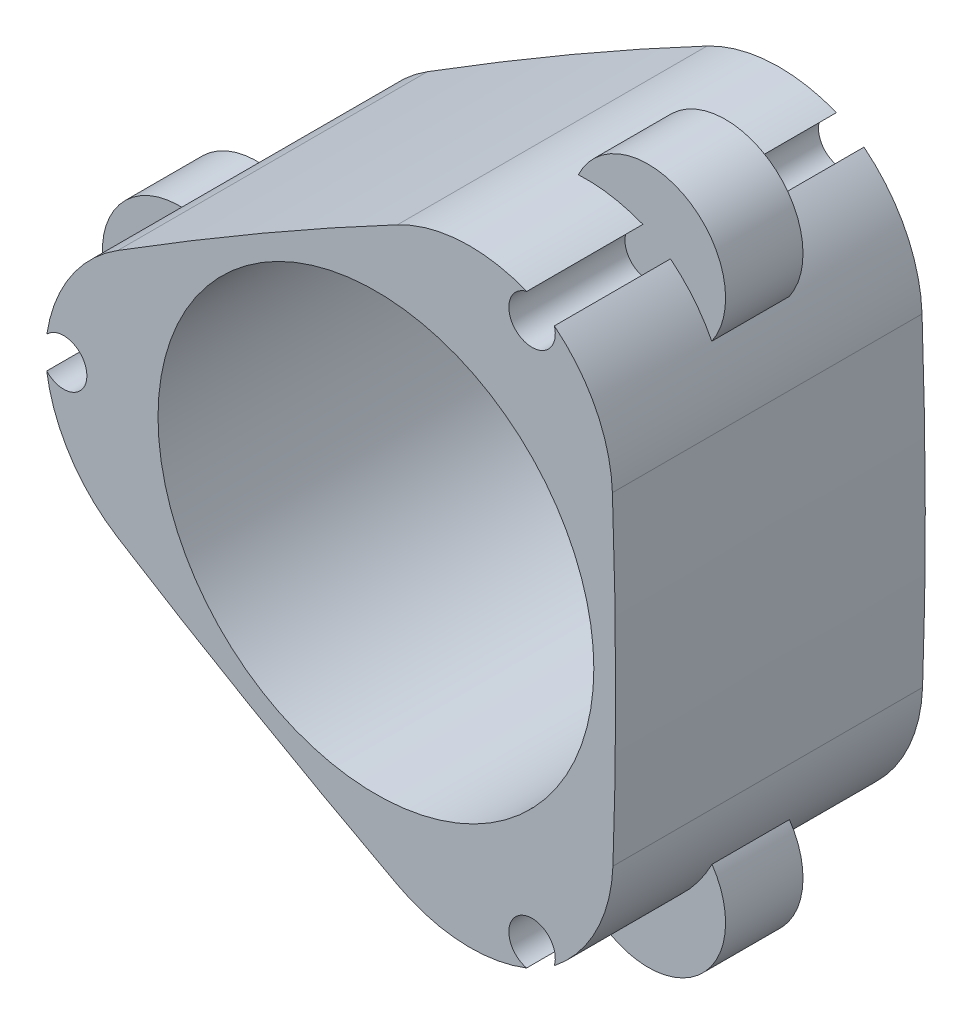
ISO-10303-21;
HEADER;
FILE_DESCRIPTION(('STEP AP214'),'2;1');
FILE_NAME('part.step','',(''),(''),'','','');
FILE_SCHEMA(('AUTOMOTIVE_DESIGN { 1 0 10303 214 1 1 1 1 }'));
ENDSEC;
DATA;
#1=APPLICATION_CONTEXT('core data for automotive mechanical design processes');
#2=APPLICATION_PROTOCOL_DEFINITION('international standard','automotive_design',2000,#1);
#3=PRODUCT_CONTEXT('',#1,'mechanical');
#4=PRODUCT('Part','Part','',(#3));
#5=PRODUCT_RELATED_PRODUCT_CATEGORY('part','',(#4));
#6=PRODUCT_DEFINITION_FORMATION('','',#4);
#7=PRODUCT_DEFINITION_CONTEXT('part definition',#1,'design');
#8=PRODUCT_DEFINITION('design','',#6,#7);
#9=PRODUCT_DEFINITION_SHAPE('','',#8);
#10=(LENGTH_UNIT() NAMED_UNIT(*) SI_UNIT(.MILLI.,.METRE.));
#11=(NAMED_UNIT(*) PLANE_ANGLE_UNIT() SI_UNIT($,.RADIAN.));
#12=(NAMED_UNIT(*) SI_UNIT($,.STERADIAN.) SOLID_ANGLE_UNIT());
#13=UNCERTAINTY_MEASURE_WITH_UNIT(LENGTH_MEASURE(1.E-05),#10,'distance_accuracy_value','');
#14=(GEOMETRIC_REPRESENTATION_CONTEXT(3) GLOBAL_UNCERTAINTY_ASSIGNED_CONTEXT((#13)) GLOBAL_UNIT_ASSIGNED_CONTEXT((#10,
#11,#12)) REPRESENTATION_CONTEXT('',''));
#15=CARTESIAN_POINT('',(0.,0.,0.));
#16=DIRECTION('',(0.,0.,1.));
#17=DIRECTION('',(1.,0.,0.));
#18=AXIS2_PLACEMENT_3D('',#15,#16,#17);
#19=CARTESIAN_POINT('',(5.31444396226365,-10.060029404627,10.));
#20=DIRECTION('',(0.,0.,-1.));
#21=DIRECTION('',(0.499999999999992,-0.866025403784443,0.));
#22=AXIS2_PLACEMENT_3D('',#19,#20,#21);
#23=CYLINDRICAL_SURFACE('',#22,10.);
#24=DIRECTION('',(0.,0.,1.));
#25=VECTOR('',#24,1.);
#26=CARTESIAN_POINT('',(14.2059920047369,-14.6360946804277,10.));
#27=LINE('',#26,#25);
#28=CARTESIAN_POINT('',(14.2059920047369,-14.6360946804277,7.5));
#29=VERTEX_POINT('',#28);
#30=CARTESIAN_POINT('',(14.2059920047369,-14.6360946804277,12.5));
#31=VERTEX_POINT('',#30);
#32=EDGE_CURVE('E196',#29,#31,#27,.T.);
#33=ORIENTED_EDGE('',*,*,#32,.F.);
#34=CARTESIAN_POINT('',(5.31444396226365,-10.060029404627,7.5));
#35=DIRECTION('',(0.,0.,1.));
#36=DIRECTION('',(1.,0.,0.));
#37=AXIS2_PLACEMENT_3D('',#34,#35,#36);
#38=CIRCLE('',#37,10.);
#39=CARTESIAN_POINT('',(11.5201825017126,-17.9015094422218,7.5));
#40=VERTEX_POINT('',#39);
#41=EDGE_CURVE('E205',#29,#40,#38,.F.);
#42=ORIENTED_EDGE('',*,*,#41,.T.);
#43=DIRECTION('',(0.,0.,1.));
#44=VECTOR('',#43,1.);
#45=CARTESIAN_POINT('',(11.5201825017126,-17.9015094422218,10.000006));
#46=LINE('',#45,#44);
#47=CARTESIAN_POINT('',(11.5201825017126,-17.9015094422218,0.));
#48=VERTEX_POINT('',#47);
#49=EDGE_CURVE('E277',#48,#40,#46,.T.);
#50=ORIENTED_EDGE('',*,*,#49,.F.);
#51=CARTESIAN_POINT('',(5.31444396226365,-10.060029404627,0.));
#52=DIRECTION('',(0.,0.,1.));
#53=DIRECTION('',(-0.499999999999992,0.866025403784443,0.));
#54=AXIS2_PLACEMENT_3D('',#51,#52,#53);
#55=CIRCLE('',#54,10.);
#56=CARTESIAN_POINT('',(15.3071980240077,-10.4406424121515,0.));
#57=VERTEX_POINT('',#56);
#58=EDGE_CURVE('E293',#57,#48,#55,.F.);
#59=ORIENTED_EDGE('',*,*,#58,.F.);
#60=DIRECTION('',(0.,0.,-1.));
#61=VECTOR('',#60,1.);
#62=CARTESIAN_POINT('',(15.3071980240077,-10.4406424121515,20.));
#63=LINE('',#62,#61);
#64=CARTESIAN_POINT('',(15.3071980240077,-10.4406424121515,20.));
#65=VERTEX_POINT('',#64);
#66=EDGE_CURVE('E288',#65,#57,#63,.T.);
#67=ORIENTED_EDGE('',*,*,#66,.F.);
#68=CARTESIAN_POINT('',(5.31444396226365,-10.060029404627,20.));
#69=DIRECTION('',(0.,0.,1.));
#70=DIRECTION('',(-0.499999999999992,0.866025403784443,0.));
#71=AXIS2_PLACEMENT_3D('',#68,#69,#70);
#72=CIRCLE('',#71,10.);
#73=CARTESIAN_POINT('',(11.5201825017126,-17.9015094422218,20.));
#74=VERTEX_POINT('',#73);
#75=EDGE_CURVE('E291',#74,#65,#72,.T.);
#76=ORIENTED_EDGE('',*,*,#75,.F.);
#77=CARTESIAN_POINT('',(11.5201825017126,-17.9015094422218,12.5));
#78=VERTEX_POINT('',#77);
#79=EDGE_CURVE('E213',#78,#74,#46,.T.);
#80=ORIENTED_EDGE('',*,*,#79,.F.);
#81=CARTESIAN_POINT('',(5.31444396226365,-10.060029404627,12.5));
#82=DIRECTION('',(0.,0.,1.));
#83=DIRECTION('',(1.,0.,0.));
#84=AXIS2_PLACEMENT_3D('',#81,#82,#83);
#85=CIRCLE('',#84,10.);
#86=EDGE_CURVE('E48',#31,#78,#85,.F.);
#87=ORIENTED_EDGE('',*,*,#86,.F.);
#88=EDGE_LOOP('',(#33,#42,#50,#59,#67,#76,#80,#87));
#89=FACE_BOUND('',#88,.T.);
#90=ADVANCED_FACE('F33',(#89),#23,.T.);
#91=CARTESIAN_POINT('',(6.08763536477849,-9.61187816794919,10.));
#92=DIRECTION('',(0.,0.,-1.));
#93=DIRECTION('',(0.499999999999992,-0.866025403784443,0.));
#94=AXIS2_PLACEMENT_3D('',#91,#92,#93);
#95=CYLINDRICAL_SURFACE('',#94,10.);
#96=DIRECTION('',(0.,0.,1.));
#97=VECTOR('',#96,1.);
#98=CARTESIAN_POINT('',(9.7308439260294,-18.9246130712538,10.000006));
#99=LINE('',#98,#97);
#100=CARTESIAN_POINT('',(9.73084392602939,-18.9246130712538,7.5));
#101=VERTEX_POINT('',#100);
#102=CARTESIAN_POINT('',(9.73084392602939,-18.9246130712538,0.));
#103=VERTEX_POINT('',#102);
#104=EDGE_CURVE('E433',#101,#103,#99,.F.);
#105=ORIENTED_EDGE('',*,*,#104,.F.);
#106=CARTESIAN_POINT('',(6.08763536477849,-9.61187816794919,7.5));
#107=DIRECTION('',(0.,0.,1.));
#108=DIRECTION('',(1.,0.,0.));
#109=AXIS2_PLACEMENT_3D('',#106,#107,#108);
#110=CIRCLE('',#109,10.);
#111=CARTESIAN_POINT('',(5.56143368454316,-19.5980241608594,7.5));
#112=VERTEX_POINT('',#111);
#113=EDGE_CURVE('E214',#101,#112,#110,.F.);
#114=ORIENTED_EDGE('',*,*,#113,.T.);
#115=DIRECTION('',(0.,0.,1.));
#116=VECTOR('',#115,1.);
#117=CARTESIAN_POINT('',(5.56143368454316,-19.5980241608594,10.));
#118=LINE('',#117,#116);
#119=CARTESIAN_POINT('',(5.56143368454316,-19.5980241608594,12.5));
#120=VERTEX_POINT('',#119);
#121=EDGE_CURVE('E11',#120,#112,#118,.F.);
#122=ORIENTED_EDGE('',*,*,#121,.F.);
#123=CARTESIAN_POINT('',(6.08763536477849,-9.61187816794919,12.5));
#124=DIRECTION('',(0.,0.,1.));
#125=DIRECTION('',(1.,0.,0.));
#126=AXIS2_PLACEMENT_3D('',#123,#124,#125);
#127=CIRCLE('',#126,10.);
#128=CARTESIAN_POINT('',(9.73084392602939,-18.9246130712538,12.5));
#129=VERTEX_POINT('',#128);
#130=EDGE_CURVE('E209',#129,#120,#127,.F.);
#131=ORIENTED_EDGE('',*,*,#130,.F.);
#132=CARTESIAN_POINT('',(9.7308439260294,-18.9246130712538,20.));
#133=VERTEX_POINT('',#132);
#134=EDGE_CURVE('E434',#133,#129,#99,.F.);
#135=ORIENTED_EDGE('',*,*,#134,.F.);
#136=CARTESIAN_POINT('',(6.08763536477849,-9.61187816794919,20.));
#137=DIRECTION('',(0.,0.,1.));
#138=DIRECTION('',(-0.499999999999992,0.866025403784443,0.));
#139=AXIS2_PLACEMENT_3D('',#136,#137,#138);
#140=CIRCLE('',#139,10.);
#141=CARTESIAN_POINT('',(1.39850135776639,-18.4443196347398,20.));
#142=VERTEX_POINT('',#141);
#143=EDGE_CURVE('E280',#142,#133,#140,.T.);
#144=ORIENTED_EDGE('',*,*,#143,.F.);
#145=DIRECTION('',(0.,0.,-1.));
#146=VECTOR('',#145,1.);
#147=CARTESIAN_POINT('',(1.39850135776622,-18.4443196347397,0.));
#148=LINE('',#147,#146);
#149=CARTESIAN_POINT('',(1.39850135776622,-18.4443196347397,0.));
#150=VERTEX_POINT('',#149);
#151=EDGE_CURVE('E283',#150,#142,#148,.F.);
#152=ORIENTED_EDGE('',*,*,#151,.F.);
#153=CARTESIAN_POINT('',(6.08763536477849,-9.61187816794919,0.));
#154=DIRECTION('',(0.,0.,1.));
#155=DIRECTION('',(-0.499999999999992,0.866025403784443,0.));
#156=AXIS2_PLACEMENT_3D('',#153,#154,#155);
#157=CIRCLE('',#156,10.);
#158=EDGE_CURVE('E286',#103,#150,#157,.F.);
#159=ORIENTED_EDGE('',*,*,#158,.F.);
#160=EDGE_LOOP('',(#105,#114,#122,#131,#135,#144,#152,#159));
#161=FACE_BOUND('',#160,.T.);
#162=ADVANCED_FACE('F358',(#161),#95,.T.);
#163=CARTESIAN_POINT('',(10.0845225836502,-17.4669054849583,0.));
#164=DIRECTION('',(0.,0.,1.));
#165=DIRECTION('',(1.,0.,0.));
#166=AXIS2_PLACEMENT_3D('',#163,#164,#165);
#167=CYLINDRICAL_SURFACE('',#166,1.5);
#168=CARTESIAN_POINT('',(10.0845225836502,-17.4669054849583,7.5));
#169=DIRECTION('',(0.,0.,1.));
#170=DIRECTION('',(1.,0.,0.));
#171=AXIS2_PLACEMENT_3D('',#168,#169,#170);
#172=CIRCLE('',#171,1.5);
#173=EDGE_CURVE('E41',#101,#40,#172,.F.);
#174=ORIENTED_EDGE('',*,*,#173,.F.);
#175=ORIENTED_EDGE('',*,*,#104,.T.);
#176=CARTESIAN_POINT('',(10.0845225836502,-17.4669054849583,0.));
#177=DIRECTION('',(0.,0.,1.));
#178=DIRECTION('',(1.,0.,0.));
#179=AXIS2_PLACEMENT_3D('',#176,#177,#178);
#180=CIRCLE('',#179,1.5);
#181=EDGE_CURVE('E272',#48,#103,#180,.T.);
#182=ORIENTED_EDGE('',*,*,#181,.F.);
#183=ORIENTED_EDGE('',*,*,#49,.T.);
#184=EDGE_LOOP('',(#174,#175,#182,#183));
#185=FACE_BOUND('',#184,.T.);
#186=ADVANCED_FACE('F363',(#185),#167,.F.);
#187=CARTESIAN_POINT('',(6.05501904609355,9.63245818062268,10.));
#188=DIRECTION('',(0.,0.,-1.));
#189=DIRECTION('',(0.500000000000004,0.866025403784436,0.));
#190=AXIS2_PLACEMENT_3D('',#187,#188,#189);
#191=CYLINDRICAL_SURFACE('',#190,10.);
#192=DIRECTION('',(0.,0.,1.));
#193=VECTOR('',#192,1.);
#194=CARTESIAN_POINT('',(5.57223380307614,19.6207973022747,10.));
#195=LINE('',#194,#193);
#196=CARTESIAN_POINT('',(5.57223380307614,19.6207973022747,7.5));
#197=VERTEX_POINT('',#196);
#198=CARTESIAN_POINT('',(5.57223380307614,19.6207973022747,12.5));
#199=VERTEX_POINT('',#198);
#200=EDGE_CURVE('E234',#197,#199,#195,.T.);
#201=ORIENTED_EDGE('',*,*,#200,.F.);
#202=CARTESIAN_POINT('',(6.05501904609355,9.63245818062268,7.5));
#203=DIRECTION('',(0.,0.,1.));
#204=DIRECTION('',(1.,0.,0.));
#205=AXIS2_PLACEMENT_3D('',#202,#203,#204);
#206=CIRCLE('',#205,10.);
#207=CARTESIAN_POINT('',(9.74307069219473,18.927525423827,7.5));
#208=VERTEX_POINT('',#207);
#209=EDGE_CURVE('E231',#197,#208,#206,.F.);
#210=ORIENTED_EDGE('',*,*,#209,.T.);
#211=DIRECTION('',(0.,0.,1.));
#212=VECTOR('',#211,1.);
#213=CARTESIAN_POINT('',(9.74307069219473,18.927525423827,10.000006));
#214=LINE('',#213,#212);
#215=CARTESIAN_POINT('',(9.74307069219473,18.927525423827,0.));
#216=VERTEX_POINT('',#215);
#217=EDGE_CURVE('E263',#216,#208,#214,.T.);
#218=ORIENTED_EDGE('',*,*,#217,.F.);
#219=CARTESIAN_POINT('',(6.05501904609355,9.63245818062268,0.));
#220=DIRECTION('',(0.,0.,1.));
#221=DIRECTION('',(-0.500000000000004,-0.866025403784436,0.));
#222=AXIS2_PLACEMENT_3D('',#219,#220,#221);
#223=CIRCLE('',#222,10.);
#224=CARTESIAN_POINT('',(1.38826254874848,18.4767435556254,0.));
#225=VERTEX_POINT('',#224);
#226=EDGE_CURVE('E309',#225,#216,#223,.F.);
#227=ORIENTED_EDGE('',*,*,#226,.F.);
#228=DIRECTION('',(0.,0.,-1.));
#229=VECTOR('',#228,1.);
#230=CARTESIAN_POINT('',(1.38826254874848,18.4767435556254,20.));
#231=LINE('',#230,#229);
#232=CARTESIAN_POINT('',(1.38826254874848,18.4767435556254,20.));
#233=VERTEX_POINT('',#232);
#234=EDGE_CURVE('E304',#233,#225,#231,.T.);
#235=ORIENTED_EDGE('',*,*,#234,.F.);
#236=CARTESIAN_POINT('',(6.05501904609355,9.63245818062268,20.));
#237=DIRECTION('',(0.,0.,1.));
#238=DIRECTION('',(-0.500000000000004,-0.866025403784436,0.));
#239=AXIS2_PLACEMENT_3D('',#236,#237,#238);
#240=CIRCLE('',#239,10.);
#241=CARTESIAN_POINT('',(9.74307069219473,18.927525423827,20.));
#242=VERTEX_POINT('',#241);
#243=EDGE_CURVE('E307',#242,#233,#240,.T.);
#244=ORIENTED_EDGE('',*,*,#243,.F.);
#245=CARTESIAN_POINT('',(9.74307069219473,18.927525423827,12.5));
#246=VERTEX_POINT('',#245);
#247=EDGE_CURVE('E262',#246,#242,#214,.T.);
#248=ORIENTED_EDGE('',*,*,#247,.F.);
#249=CARTESIAN_POINT('',(6.05501904609355,9.63245818062268,12.5));
#250=DIRECTION('',(0.,0.,1.));
#251=DIRECTION('',(1.,0.,0.));
#252=AXIS2_PLACEMENT_3D('',#249,#250,#251);
#253=CIRCLE('',#252,10.);
#254=EDGE_CURVE('E56',#199,#246,#253,.F.);
#255=ORIENTED_EDGE('',*,*,#254,.F.);
#256=EDGE_LOOP('',(#201,#210,#218,#227,#235,#244,#248,#255));
#257=FACE_BOUND('',#256,.T.);
#258=ADVANCED_FACE('F371',(#257),#191,.T.);
#259=CARTESIAN_POINT('',(5.28031298913574,10.0779859588493,10.));
#260=DIRECTION('',(0.,0.,-1.));
#261=DIRECTION('',(0.500000000000004,0.866025403784436,0.));
#262=AXIS2_PLACEMENT_3D('',#259,#260,#261);
#263=CYLINDRICAL_SURFACE('',#262,10.);
#264=DIRECTION('',(0.,0.,1.));
#265=VECTOR('',#264,1.);
#266=CARTESIAN_POINT('',(11.5237737134821,17.8894645758299,10.000006));
#267=LINE('',#266,#265);
#268=CARTESIAN_POINT('',(11.5237737134821,17.8894645758299,7.5));
#269=VERTEX_POINT('',#268);
#270=CARTESIAN_POINT('',(11.5237737134821,17.8894645758299,0.));
#271=VERTEX_POINT('',#270);
#272=EDGE_CURVE('E437',#269,#271,#267,.F.);
#273=ORIENTED_EDGE('',*,*,#272,.F.);
#274=CARTESIAN_POINT('',(5.28031298913574,10.0779859588493,7.5));
#275=DIRECTION('',(0.,0.,1.));
#276=DIRECTION('',(1.,0.,0.));
#277=AXIS2_PLACEMENT_3D('',#274,#275,#276);
#278=CIRCLE('',#277,10.);
#279=CARTESIAN_POINT('',(14.1916699450138,14.6153549327067,7.5));
#280=VERTEX_POINT('',#279);
#281=EDGE_CURVE('E228',#269,#280,#278,.F.);
#282=ORIENTED_EDGE('',*,*,#281,.T.);
#283=DIRECTION('',(0.,0.,1.));
#284=VECTOR('',#283,1.);
#285=CARTESIAN_POINT('',(14.1916699450138,14.6153549327067,10.));
#286=LINE('',#285,#284);
#287=CARTESIAN_POINT('',(14.1916699450138,14.6153549327067,12.5));
#288=VERTEX_POINT('',#287);
#289=EDGE_CURVE('E456',#288,#280,#286,.F.);
#290=ORIENTED_EDGE('',*,*,#289,.F.);
#291=CARTESIAN_POINT('',(5.28031298913574,10.0779859588493,12.5));
#292=DIRECTION('',(0.,0.,1.));
#293=DIRECTION('',(1.,0.,0.));
#294=AXIS2_PLACEMENT_3D('',#291,#292,#293);
#295=CIRCLE('',#294,10.);
#296=CARTESIAN_POINT('',(11.5237737134821,17.8894645758299,12.5));
#297=VERTEX_POINT('',#296);
#298=EDGE_CURVE('E224',#297,#288,#295,.F.);
#299=ORIENTED_EDGE('',*,*,#298,.F.);
#300=CARTESIAN_POINT('',(11.5237737134821,17.8894645758299,20.));
#301=VERTEX_POINT('',#300);
#302=EDGE_CURVE('E438',#301,#297,#267,.F.);
#303=ORIENTED_EDGE('',*,*,#302,.F.);
#304=CARTESIAN_POINT('',(5.28031298913574,10.0779859588493,20.));
#305=DIRECTION('',(0.,0.,1.));
#306=DIRECTION('',(-0.500000000000004,-0.866025403784436,0.));
#307=AXIS2_PLACEMENT_3D('',#304,#305,#306);
#308=CIRCLE('',#307,10.);
#309=CARTESIAN_POINT('',(15.2739986803215,10.4332975204226,20.));
#310=VERTEX_POINT('',#309);
#311=EDGE_CURVE('E296',#310,#301,#308,.T.);
#312=ORIENTED_EDGE('',*,*,#311,.F.);
#313=DIRECTION('',(0.,0.,-1.));
#314=VECTOR('',#313,1.);
#315=CARTESIAN_POINT('',(15.2739986803216,10.4332975204225,0.));
#316=LINE('',#315,#314);
#317=CARTESIAN_POINT('',(15.2739986803216,10.4332975204225,0.));
#318=VERTEX_POINT('',#317);
#319=EDGE_CURVE('E299',#318,#310,#316,.F.);
#320=ORIENTED_EDGE('',*,*,#319,.F.);
#321=CARTESIAN_POINT('',(5.28031298913574,10.0779859588493,0.));
#322=DIRECTION('',(0.,0.,1.));
#323=DIRECTION('',(-0.500000000000004,-0.866025403784436,0.));
#324=AXIS2_PLACEMENT_3D('',#321,#322,#323);
#325=CIRCLE('',#324,10.);
#326=EDGE_CURVE('E302',#271,#318,#325,.F.);
#327=ORIENTED_EDGE('',*,*,#326,.F.);
#328=EDGE_LOOP('',(#273,#282,#290,#299,#303,#312,#320,#327));
#329=FACE_BOUND('',#328,.T.);
#330=ADVANCED_FACE('F368',(#329),#263,.T.);
#331=CARTESIAN_POINT('',(10.0845225836504,17.4669054849581,0.));
#332=DIRECTION('',(0.,0.,1.));
#333=DIRECTION('',(1.,0.,0.));
#334=AXIS2_PLACEMENT_3D('',#331,#332,#333);
#335=CYLINDRICAL_SURFACE('',#334,1.5);
#336=CARTESIAN_POINT('',(10.0845225836504,17.4669054849581,7.5));
#337=DIRECTION('',(0.,0.,1.));
#338=DIRECTION('',(1.,0.,0.));
#339=AXIS2_PLACEMENT_3D('',#336,#337,#338);
#340=CIRCLE('',#339,1.5);
#341=EDGE_CURVE('E454',#269,#208,#340,.F.);
#342=ORIENTED_EDGE('',*,*,#341,.F.);
#343=ORIENTED_EDGE('',*,*,#272,.T.);
#344=CARTESIAN_POINT('',(10.0845225836504,17.4669054849581,0.));
#345=DIRECTION('',(0.,0.,1.));
#346=DIRECTION('',(1.,0.,0.));
#347=AXIS2_PLACEMENT_3D('',#344,#345,#346);
#348=CIRCLE('',#347,1.5);
#349=EDGE_CURVE('E255',#216,#271,#348,.T.);
#350=ORIENTED_EDGE('',*,*,#349,.F.);
#351=ORIENTED_EDGE('',*,*,#217,.T.);
#352=EDGE_LOOP('',(#342,#343,#350,#351));
#353=FACE_BOUND('',#352,.T.);
#354=ADVANCED_FACE('F354',(#353),#335,.F.);
#355=CARTESIAN_POINT('',(-11.3694630083572,0.427571224004244,10.));
#356=DIRECTION('',(0.,0.,-1.));
#357=DIRECTION('',(-1.,0.,0.));
#358=AXIS2_PLACEMENT_3D('',#355,#356,#357);
#359=CYLINDRICAL_SURFACE('',#358,10.);
#360=DIRECTION('',(0.,0.,1.));
#361=VECTOR('',#360,1.);
#362=CARTESIAN_POINT('',(-19.7782258078131,-4.98470262184714,10.));
#363=LINE('',#362,#361);
#364=CARTESIAN_POINT('',(-19.7782258078131,-4.98470262184714,7.5));
#365=VERTEX_POINT('',#364);
#366=CARTESIAN_POINT('',(-19.7782258078131,-4.98470262184714,12.5));
#367=VERTEX_POINT('',#366);
#368=EDGE_CURVE('E252',#365,#367,#363,.T.);
#369=ORIENTED_EDGE('',*,*,#368,.F.);
#370=CARTESIAN_POINT('',(-11.3694630083572,0.427571224004244,7.5));
#371=DIRECTION('',(0.,0.,1.));
#372=DIRECTION('',(1.,0.,0.));
#373=AXIS2_PLACEMENT_3D('',#370,#371,#372);
#374=CIRCLE('',#373,10.);
#375=CARTESIAN_POINT('',(-21.2632531939074,-1.02601598160534,7.5));
#376=VERTEX_POINT('',#375);
#377=EDGE_CURVE('E249',#365,#376,#374,.F.);
#378=ORIENTED_EDGE('',*,*,#377,.T.);
#379=DIRECTION('',(0.,0.,1.));
#380=VECTOR('',#379,1.);
#381=CARTESIAN_POINT('',(-21.2632531939074,-1.02601598160534,10.000006));
#382=LINE('',#381,#380);
#383=CARTESIAN_POINT('',(-21.2632531939074,-1.02601598160534,0.));
#384=VERTEX_POINT('',#383);
#385=EDGE_CURVE('E269',#384,#376,#382,.T.);
#386=ORIENTED_EDGE('',*,*,#385,.F.);
#387=CARTESIAN_POINT('',(-11.3694630083572,0.427571224004244,0.));
#388=DIRECTION('',(0.,0.,1.));
#389=DIRECTION('',(1.,0.,0.));
#390=AXIS2_PLACEMENT_3D('',#387,#388,#389);
#391=CIRCLE('',#390,10.);
#392=CARTESIAN_POINT('',(-16.6954605727562,-8.03610114347407,0.));
#393=VERTEX_POINT('',#392);
#394=EDGE_CURVE('E393',#393,#384,#391,.F.);
#395=ORIENTED_EDGE('',*,*,#394,.F.);
#396=DIRECTION('',(0.,0.,-1.));
#397=VECTOR('',#396,1.);
#398=CARTESIAN_POINT('',(-16.6954605727562,-8.03610114347407,20.));
#399=LINE('',#398,#397);
#400=CARTESIAN_POINT('',(-16.6954605727562,-8.03610114347407,20.));
#401=VERTEX_POINT('',#400);
#402=EDGE_CURVE('E431',#401,#393,#399,.T.);
#403=ORIENTED_EDGE('',*,*,#402,.F.);
#404=CARTESIAN_POINT('',(-11.3694630083572,0.427571224004244,20.));
#405=DIRECTION('',(0.,0.,1.));
#406=DIRECTION('',(1.,0.,0.));
#407=AXIS2_PLACEMENT_3D('',#404,#405,#406);
#408=CIRCLE('',#407,10.);
#409=CARTESIAN_POINT('',(-21.2632531939074,-1.02601598160534,20.));
#410=VERTEX_POINT('',#409);
#411=EDGE_CURVE('E426',#410,#401,#408,.T.);
#412=ORIENTED_EDGE('',*,*,#411,.F.);
#413=CARTESIAN_POINT('',(-21.2632531939074,-1.02601598160534,12.5));
#414=VERTEX_POINT('',#413);
#415=EDGE_CURVE('E268',#414,#410,#382,.T.);
#416=ORIENTED_EDGE('',*,*,#415,.F.);
#417=CARTESIAN_POINT('',(-11.3694630083572,0.427571224004244,12.5));
#418=DIRECTION('',(0.,0.,1.));
#419=DIRECTION('',(1.,0.,0.));
#420=AXIS2_PLACEMENT_3D('',#417,#418,#419);
#421=CIRCLE('',#420,10.);
#422=EDGE_CURVE('E244',#367,#414,#421,.F.);
#423=ORIENTED_EDGE('',*,*,#422,.F.);
#424=EDGE_LOOP('',(#369,#378,#386,#395,#403,#412,#416,#423));
#425=FACE_BOUND('',#424,.T.);
#426=ADVANCED_FACE('F35',(#425),#359,.T.);
#427=CARTESIAN_POINT('',(-11.3679483539143,-0.466107790900228,10.));
#428=DIRECTION('',(0.,0.,-1.));
#429=DIRECTION('',(-1.,0.,0.));
#430=AXIS2_PLACEMENT_3D('',#427,#428,#429);
#431=CYLINDRICAL_SURFACE('',#430,10.);
#432=DIRECTION('',(0.,0.,1.));
#433=VECTOR('',#432,1.);
#434=CARTESIAN_POINT('',(-21.2546176395116,1.03514849542376,10.000006));
#435=LINE('',#434,#433);
#436=CARTESIAN_POINT('',(-21.2546176395116,1.03514849542376,7.5));
#437=VERTEX_POINT('',#436);
#438=CARTESIAN_POINT('',(-21.2546176395116,1.03514849542376,0.));
#439=VERTEX_POINT('',#438);
#440=EDGE_CURVE('E441',#437,#439,#435,.F.);
#441=ORIENTED_EDGE('',*,*,#440,.F.);
#442=CARTESIAN_POINT('',(-11.3679483539143,-0.466107790900228,7.5));
#443=DIRECTION('',(0.,0.,1.));
#444=DIRECTION('',(1.,0.,0.));
#445=AXIS2_PLACEMENT_3D('',#442,#443,#444);
#446=CIRCLE('',#445,10.);
#447=CARTESIAN_POINT('',(-19.7531036295571,4.98266922815267,7.5));
#448=VERTEX_POINT('',#447);
#449=EDGE_CURVE('E246',#437,#448,#446,.F.);
#450=ORIENTED_EDGE('',*,*,#449,.T.);
#451=DIRECTION('',(0.,0.,1.));
#452=VECTOR('',#451,1.);
#453=CARTESIAN_POINT('',(-19.7531036295571,4.98266922815267,10.));
#454=LINE('',#453,#452);
#455=CARTESIAN_POINT('',(-19.7531036295571,4.98266922815267,12.5));
#456=VERTEX_POINT('',#455);
#457=EDGE_CURVE('E450',#456,#448,#454,.F.);
#458=ORIENTED_EDGE('',*,*,#457,.F.);
#459=CARTESIAN_POINT('',(-11.3679483539143,-0.466107790900228,12.5));
#460=DIRECTION('',(0.,0.,1.));
#461=DIRECTION('',(1.,0.,0.));
#462=AXIS2_PLACEMENT_3D('',#459,#460,#461);
#463=CIRCLE('',#462,10.);
#464=CARTESIAN_POINT('',(-21.2546176395116,1.03514849542376,12.5));
#465=VERTEX_POINT('',#464);
#466=EDGE_CURVE('E240',#465,#456,#463,.F.);
#467=ORIENTED_EDGE('',*,*,#466,.F.);
#468=CARTESIAN_POINT('',(-21.2546176395116,1.03514849542376,20.));
#469=VERTEX_POINT('',#468);
#470=EDGE_CURVE('E442',#469,#465,#435,.F.);
#471=ORIENTED_EDGE('',*,*,#470,.F.);
#472=CARTESIAN_POINT('',(-11.3679483539143,-0.466107790900228,20.));
#473=DIRECTION('',(0.,0.,1.));
#474=DIRECTION('',(1.,0.,0.));
#475=AXIS2_PLACEMENT_3D('',#472,#473,#474);
#476=CIRCLE('',#475,10.);
#477=CARTESIAN_POINT('',(-16.6725000380879,8.01102211431714,20.));
#478=VERTEX_POINT('',#477);
#479=EDGE_CURVE('E428',#478,#469,#476,.T.);
#480=ORIENTED_EDGE('',*,*,#479,.F.);
#481=DIRECTION('',(0.,0.,-1.));
#482=VECTOR('',#481,1.);
#483=CARTESIAN_POINT('',(-16.6725000380879,8.01102211431714,0.));
#484=LINE('',#483,#482);
#485=CARTESIAN_POINT('',(-16.6725000380879,8.01102211431714,0.));
#486=VERTEX_POINT('',#485);
#487=EDGE_CURVE('E423',#486,#478,#484,.F.);
#488=ORIENTED_EDGE('',*,*,#487,.F.);
#489=CARTESIAN_POINT('',(-11.3679483539143,-0.466107790900228,0.));
#490=DIRECTION('',(0.,0.,1.));
#491=DIRECTION('',(1.,0.,0.));
#492=AXIS2_PLACEMENT_3D('',#489,#490,#491);
#493=CIRCLE('',#492,10.);
#494=EDGE_CURVE('E421',#439,#486,#493,.F.);
#495=ORIENTED_EDGE('',*,*,#494,.F.);
#496=EDGE_LOOP('',(#441,#450,#458,#467,#471,#480,#488,#495));
#497=FACE_BOUND('',#496,.T.);
#498=ADVANCED_FACE('F342',(#497),#431,.T.);
#499=CARTESIAN_POINT('',(-20.1690451673007,0.,0.));
#500=DIRECTION('',(0.,0.,1.));
#501=DIRECTION('',(1.,0.,0.));
#502=AXIS2_PLACEMENT_3D('',#499,#500,#501);
#503=CYLINDRICAL_SURFACE('',#502,1.5);
#504=CARTESIAN_POINT('',(-20.1690451673007,0.,7.5));
#505=DIRECTION('',(0.,0.,1.));
#506=DIRECTION('',(1.,0.,0.));
#507=AXIS2_PLACEMENT_3D('',#504,#505,#506);
#508=CIRCLE('',#507,1.5);
#509=EDGE_CURVE('E448',#437,#376,#508,.F.);
#510=ORIENTED_EDGE('',*,*,#509,.F.);
#511=ORIENTED_EDGE('',*,*,#440,.T.);
#512=CARTESIAN_POINT('',(-20.1690451673007,0.,0.));
#513=DIRECTION('',(0.,0.,1.));
#514=DIRECTION('',(1.,0.,0.));
#515=AXIS2_PLACEMENT_3D('',#512,#513,#514);
#516=CIRCLE('',#515,1.5);
#517=EDGE_CURVE('E254',#384,#439,#516,.T.);
#518=ORIENTED_EDGE('',*,*,#517,.F.);
#519=ORIENTED_EDGE('',*,*,#385,.T.);
#520=EDGE_LOOP('',(#510,#511,#518,#519));
#521=FACE_BOUND('',#520,.T.);
#522=ADVANCED_FACE('F344',(#521),#503,.F.);
#523=CARTESIAN_POINT('',(-6.99651232859779,13.8383230744308,20.));
#524=DIRECTION('',(0.,0.,1.));
#525=DIRECTION('',(1.,0.,0.));
#526=AXIS2_PLACEMENT_3D('',#523,#524,#525);
#527=PLANE('',#526);
#528=CARTESIAN_POINT('',(10.0845225836504,17.4669054849581,20.));
#529=DIRECTION('',(0.,0.,1.));
#530=DIRECTION('',(1.,0.,0.));
#531=AXIS2_PLACEMENT_3D('',#528,#529,#530);
#532=CIRCLE('',#531,1.5);
#533=EDGE_CURVE('E258',#242,#301,#532,.T.);
#534=ORIENTED_EDGE('',*,*,#533,.F.);
#535=ORIENTED_EDGE('',*,*,#243,.T.);
#536=CARTESIAN_POINT('',(5.58806613566207,20.6342197117668,20.));
#537=CARTESIAN_POINT('',(-6.45516196228126,14.6206849807919,20.));
#538=CARTESIAN_POINT('',(-20.6637915254907,5.47770262437253,20.));
#539=B_SPLINE_CURVE_WITH_KNOTS('',2,(#536,#537,#538),.UNSPECIFIED.,.F.,.F.,(3,3),(0.,1.),.UNSPECIFIED.);
#540=EDGE_CURVE('E319',#233,#478,#539,.T.);
#541=ORIENTED_EDGE('',*,*,#540,.T.);
#542=ORIENTED_EDGE('',*,*,#479,.T.);
#543=CARTESIAN_POINT('',(-20.1690451673007,0.,20.));
#544=DIRECTION('',(0.,0.,1.));
#545=DIRECTION('',(1.,0.,0.));
#546=AXIS2_PLACEMENT_3D('',#543,#544,#545);
#547=CIRCLE('',#546,1.5);
#548=EDGE_CURVE('E266',#410,#469,#547,.T.);
#549=ORIENTED_EDGE('',*,*,#548,.F.);
#550=ORIENTED_EDGE('',*,*,#411,.T.);
#551=CARTESIAN_POINT('',(-20.6637915254907,-5.47770262437252,20.));
#552=CARTESIAN_POINT('',(-9.43430363295479,-12.9006767352746,20.));
#553=CARTESIAN_POINT('',(5.58806613566208,-20.6342197117668,20.));
#554=B_SPLINE_CURVE_WITH_KNOTS('',2,(#551,#552,#553),.UNSPECIFIED.,.F.,.F.,(3,3),(0.,1.),.UNSPECIFIED.);
#555=EDGE_CURVE('E324',#401,#142,#554,.T.);
#556=ORIENTED_EDGE('',*,*,#555,.T.);
#557=ORIENTED_EDGE('',*,*,#143,.T.);
#558=CARTESIAN_POINT('',(10.0845225836502,-17.4669054849583,20.));
#559=DIRECTION('',(0.,0.,1.));
#560=DIRECTION('',(1.,0.,0.));
#561=AXIS2_PLACEMENT_3D('',#558,#559,#560);
#562=CIRCLE('',#561,1.5);
#563=EDGE_CURVE('E275',#74,#133,#562,.T.);
#564=ORIENTED_EDGE('',*,*,#563,.F.);
#565=ORIENTED_EDGE('',*,*,#75,.T.);
#566=CARTESIAN_POINT('',(15.0757253898287,-15.1565170873943,20.));
#567=CARTESIAN_POINT('',(15.8894655952361,-1.72000824551735,20.));
#568=CARTESIAN_POINT('',(15.0757253898287,15.1565170873943,20.));
#569=B_SPLINE_CURVE_WITH_KNOTS('',2,(#566,#567,#568),.UNSPECIFIED.,.F.,.F.,(3,3),(0.,1.),.UNSPECIFIED.);
#570=EDGE_CURVE('E388',#65,#310,#569,.T.);
#571=ORIENTED_EDGE('',*,*,#570,.T.);
#572=ORIENTED_EDGE('',*,*,#311,.T.);
#573=EDGE_LOOP('',(#534,#535,#541,#542,#549,#550,#556,#557,#564,#565,#571,#572));
#574=FACE_BOUND('',#573,.T.);
#575=CARTESIAN_POINT('',(0.,0.,20.));
#576=DIRECTION('',(0.,0.,1.));
#577=DIRECTION('',(1.,0.,0.));
#578=AXIS2_PLACEMENT_3D('',#575,#576,#577);
#579=CIRCLE('',#578,14.075);
#580=CARTESIAN_POINT('',(14.075,0.,20.));
#581=VERTEX_POINT('',#580);
#582=EDGE_CURVE('E313',#581,#581,#579,.T.);
#583=ORIENTED_EDGE('',*,*,#582,.F.);
#584=EDGE_LOOP('',(#583));
#585=FACE_BOUND('',#584,.T.);
#586=ADVANCED_FACE('F350',(#574,#585),#527,.T.);
#587=CARTESIAN_POINT('',(-6.99651232859779,13.8383230744308,0.));
#588=DIRECTION('',(0.,0.,1.));
#589=DIRECTION('',(1.,0.,0.));
#590=AXIS2_PLACEMENT_3D('',#587,#588,#589);
#591=PLANE('',#590);
#592=CARTESIAN_POINT('',(0.,0.,0.));
#593=DIRECTION('',(0.,0.,1.));
#594=DIRECTION('',(1.,0.,0.));
#595=AXIS2_PLACEMENT_3D('',#592,#593,#594);
#596=CIRCLE('',#595,14.075);
#597=CARTESIAN_POINT('',(14.075,0.,0.));
#598=VERTEX_POINT('',#597);
#599=EDGE_CURVE('E312',#598,#598,#596,.T.);
#600=ORIENTED_EDGE('',*,*,#599,.T.);
#601=EDGE_LOOP('',(#600));
#602=FACE_BOUND('',#601,.T.);
#603=ORIENTED_EDGE('',*,*,#226,.T.);
#604=ORIENTED_EDGE('',*,*,#349,.T.);
#605=ORIENTED_EDGE('',*,*,#326,.T.);
#606=CARTESIAN_POINT('',(15.0757253898287,-15.1565170873943,0.));
#607=CARTESIAN_POINT('',(15.8894655952361,-1.72000824551735,0.));
#608=CARTESIAN_POINT('',(15.0757253898287,15.1565170873943,0.));
#609=B_SPLINE_CURVE_WITH_KNOTS('',2,(#606,#607,#608),.UNSPECIFIED.,.F.,.F.,(3,3),(0.,1.),.UNSPECIFIED.);
#610=EDGE_CURVE('E325',#57,#318,#609,.T.);
#611=ORIENTED_EDGE('',*,*,#610,.F.);
#612=ORIENTED_EDGE('',*,*,#58,.T.);
#613=ORIENTED_EDGE('',*,*,#181,.T.);
#614=ORIENTED_EDGE('',*,*,#158,.T.);
#615=CARTESIAN_POINT('',(-20.6637915254907,-5.47770262437252,0.));
#616=CARTESIAN_POINT('',(-9.43430363295479,-12.9006767352746,0.));
#617=CARTESIAN_POINT('',(5.58806613566208,-20.6342197117668,0.));
#618=B_SPLINE_CURVE_WITH_KNOTS('',2,(#615,#616,#617),.UNSPECIFIED.,.F.,.F.,(3,3),(0.,1.),.UNSPECIFIED.);
#619=EDGE_CURVE('E401',#393,#150,#618,.T.);
#620=ORIENTED_EDGE('',*,*,#619,.F.);
#621=ORIENTED_EDGE('',*,*,#394,.T.);
#622=ORIENTED_EDGE('',*,*,#517,.T.);
#623=ORIENTED_EDGE('',*,*,#494,.T.);
#624=CARTESIAN_POINT('',(5.58806613566207,20.6342197117668,0.));
#625=CARTESIAN_POINT('',(-6.45516196228126,14.6206849807919,0.));
#626=CARTESIAN_POINT('',(-20.6637915254907,5.47770262437253,0.));
#627=B_SPLINE_CURVE_WITH_KNOTS('',2,(#624,#625,#626),.UNSPECIFIED.,.F.,.F.,(3,3),(0.,1.),.UNSPECIFIED.);
#628=EDGE_CURVE('E316',#225,#486,#627,.T.);
#629=ORIENTED_EDGE('',*,*,#628,.F.);
#630=EDGE_LOOP('',(#603,#604,#605,#611,#612,#613,#614,#620,#621,#622,#623,#629));
#631=FACE_BOUND('',#630,.T.);
#632=ADVANCED_FACE('F382',(#602,#631),#591,.F.);
#633=DIRECTION('',(0.,0.,-1.));
#634=VECTOR('',#633,1.);
#635=SURFACE_OF_LINEAR_EXTRUSION('',#554,#634);
#636=ORIENTED_EDGE('',*,*,#151,.T.);
#637=ORIENTED_EDGE('',*,*,#555,.F.);
#638=ORIENTED_EDGE('',*,*,#402,.T.);
#639=ORIENTED_EDGE('',*,*,#619,.T.);
#640=EDGE_LOOP('',(#636,#637,#638,#639));
#641=FACE_BOUND('',#640,.T.);
#642=ADVANCED_FACE('F340',(#641),#635,.F.);
#643=DIRECTION('',(0.,0.,-1.));
#644=VECTOR('',#643,1.);
#645=SURFACE_OF_LINEAR_EXTRUSION('',#569,#644);
#646=ORIENTED_EDGE('',*,*,#570,.F.);
#647=ORIENTED_EDGE('',*,*,#66,.T.);
#648=ORIENTED_EDGE('',*,*,#610,.T.);
#649=ORIENTED_EDGE('',*,*,#319,.T.);
#650=EDGE_LOOP('',(#646,#647,#648,#649));
#651=FACE_BOUND('',#650,.T.);
#652=ADVANCED_FACE('F338',(#651),#645,.F.);
#653=DIRECTION('',(0.,0.,-1.));
#654=VECTOR('',#653,1.);
#655=SURFACE_OF_LINEAR_EXTRUSION('',#539,#654);
#656=ORIENTED_EDGE('',*,*,#540,.F.);
#657=ORIENTED_EDGE('',*,*,#234,.T.);
#658=ORIENTED_EDGE('',*,*,#628,.T.);
#659=ORIENTED_EDGE('',*,*,#487,.T.);
#660=EDGE_LOOP('',(#656,#657,#658,#659));
#661=FACE_BOUND('',#660,.T.);
#662=ADVANCED_FACE('F334',(#661),#655,.F.);
#663=CARTESIAN_POINT('',(0.,0.,20.));
#664=DIRECTION('',(0.,0.,-1.));
#665=DIRECTION('',(-1.,0.,0.));
#666=AXIS2_PLACEMENT_3D('',#663,#664,#665);
#667=CYLINDRICAL_SURFACE('',#666,14.075);
#668=ORIENTED_EDGE('',*,*,#582,.T.);
#669=EDGE_LOOP('',(#668));
#670=FACE_BOUND('',#669,.T.);
#671=ORIENTED_EDGE('',*,*,#599,.F.);
#672=EDGE_LOOP('',(#671));
#673=FACE_BOUND('',#672,.T.);
#674=ADVANCED_FACE('F337',(#670,#673),#667,.F.);
#675=ORIENTED_EDGE('',*,*,#134,.T.);
#676=CARTESIAN_POINT('',(10.0845225836502,-17.4669054849583,12.5));
#677=DIRECTION('',(0.,0.,1.));
#678=DIRECTION('',(1.,0.,0.));
#679=AXIS2_PLACEMENT_3D('',#676,#677,#678);
#680=CIRCLE('',#679,1.5);
#681=EDGE_CURVE('E458',#129,#78,#680,.F.);
#682=ORIENTED_EDGE('',*,*,#681,.T.);
#683=ORIENTED_EDGE('',*,*,#79,.T.);
#684=ORIENTED_EDGE('',*,*,#563,.T.);
#685=EDGE_LOOP('',(#675,#682,#683,#684));
#686=FACE_BOUND('',#685,.T.);
#687=ADVANCED_FACE('F378',(#686),#167,.F.);
#688=ORIENTED_EDGE('',*,*,#302,.T.);
#689=CARTESIAN_POINT('',(10.0845225836504,17.4669054849581,12.5));
#690=DIRECTION('',(0.,0.,1.));
#691=DIRECTION('',(1.,0.,0.));
#692=AXIS2_PLACEMENT_3D('',#689,#690,#691);
#693=CIRCLE('',#692,1.5);
#694=EDGE_CURVE('E452',#297,#246,#693,.F.);
#695=ORIENTED_EDGE('',*,*,#694,.T.);
#696=ORIENTED_EDGE('',*,*,#247,.T.);
#697=ORIENTED_EDGE('',*,*,#533,.T.);
#698=EDGE_LOOP('',(#688,#695,#696,#697));
#699=FACE_BOUND('',#698,.T.);
#700=ADVANCED_FACE('F505',(#699),#335,.F.);
#701=ORIENTED_EDGE('',*,*,#470,.T.);
#702=CARTESIAN_POINT('',(-20.1690451673007,0.,12.5));
#703=DIRECTION('',(0.,0.,1.));
#704=DIRECTION('',(1.,0.,0.));
#705=AXIS2_PLACEMENT_3D('',#702,#703,#704);
#706=CIRCLE('',#705,1.5);
#707=EDGE_CURVE('E445',#465,#414,#706,.F.);
#708=ORIENTED_EDGE('',*,*,#707,.T.);
#709=ORIENTED_EDGE('',*,*,#415,.T.);
#710=ORIENTED_EDGE('',*,*,#548,.T.);
#711=EDGE_LOOP('',(#701,#708,#709,#710));
#712=FACE_BOUND('',#711,.T.);
#713=ADVANCED_FACE('F353',(#712),#503,.F.);
#714=CARTESIAN_POINT('',(-20.1690451673007,0.,7.5));
#715=DIRECTION('',(0.,0.,1.));
#716=DIRECTION('',(1.,0.,0.));
#717=AXIS2_PLACEMENT_3D('',#714,#715,#716);
#718=CYLINDRICAL_SURFACE('',#717,5.);
#719=CARTESIAN_POINT('',(-20.1690451673007,0.,7.5));
#720=DIRECTION('',(0.,0.,1.));
#721=DIRECTION('',(1.,0.,0.));
#722=AXIS2_PLACEMENT_3D('',#719,#720,#721);
#723=CIRCLE('',#722,5.);
#724=EDGE_CURVE('E237',#448,#365,#723,.T.);
#725=ORIENTED_EDGE('',*,*,#724,.T.);
#726=ORIENTED_EDGE('',*,*,#368,.T.);
#727=CARTESIAN_POINT('',(-20.1690451673007,0.,12.5));
#728=DIRECTION('',(0.,0.,1.));
#729=DIRECTION('',(1.,0.,0.));
#730=AXIS2_PLACEMENT_3D('',#727,#728,#729);
#731=CIRCLE('',#730,5.);
#732=EDGE_CURVE('E236',#456,#367,#731,.T.);
#733=ORIENTED_EDGE('',*,*,#732,.F.);
#734=ORIENTED_EDGE('',*,*,#457,.T.);
#735=EDGE_LOOP('',(#725,#726,#733,#734));
#736=FACE_BOUND('',#735,.T.);
#737=ADVANCED_FACE('F563',(#736),#718,.T.);
#738=CARTESIAN_POINT('',(-20.1690451673007,0.,7.5));
#739=DIRECTION('',(0.,0.,1.));
#740=DIRECTION('',(1.,0.,0.));
#741=AXIS2_PLACEMENT_3D('',#738,#739,#740);
#742=PLANE('',#741);
#743=ORIENTED_EDGE('',*,*,#377,.F.);
#744=ORIENTED_EDGE('',*,*,#724,.F.);
#745=ORIENTED_EDGE('',*,*,#449,.F.);
#746=ORIENTED_EDGE('',*,*,#509,.T.);
#747=EDGE_LOOP('',(#743,#744,#745,#746));
#748=FACE_BOUND('',#747,.T.);
#749=ADVANCED_FACE('F572',(#748),#742,.F.);
#750=CARTESIAN_POINT('',(-20.1690451673007,0.,12.5));
#751=DIRECTION('',(0.,0.,1.));
#752=DIRECTION('',(1.,0.,0.));
#753=AXIS2_PLACEMENT_3D('',#750,#751,#752);
#754=PLANE('',#753);
#755=ORIENTED_EDGE('',*,*,#732,.T.);
#756=ORIENTED_EDGE('',*,*,#422,.T.);
#757=ORIENTED_EDGE('',*,*,#707,.F.);
#758=ORIENTED_EDGE('',*,*,#466,.T.);
#759=EDGE_LOOP('',(#755,#756,#757,#758));
#760=FACE_BOUND('',#759,.T.);
#761=ADVANCED_FACE('F583',(#760),#754,.T.);
#762=CARTESIAN_POINT('',(10.0845225836504,17.4669054849581,7.5));
#763=DIRECTION('',(0.,0.,1.));
#764=DIRECTION('',(1.,0.,0.));
#765=AXIS2_PLACEMENT_3D('',#762,#763,#764);
#766=CYLINDRICAL_SURFACE('',#765,5.);
#767=CARTESIAN_POINT('',(10.0845225836504,17.4669054849581,7.5));
#768=DIRECTION('',(0.,0.,1.));
#769=DIRECTION('',(1.,0.,0.));
#770=AXIS2_PLACEMENT_3D('',#767,#768,#769);
#771=CIRCLE('',#770,5.);
#772=EDGE_CURVE('E221',#280,#197,#771,.T.);
#773=ORIENTED_EDGE('',*,*,#772,.T.);
#774=ORIENTED_EDGE('',*,*,#200,.T.);
#775=CARTESIAN_POINT('',(10.0845225836504,17.4669054849581,12.5));
#776=DIRECTION('',(0.,0.,1.));
#777=DIRECTION('',(1.,0.,0.));
#778=AXIS2_PLACEMENT_3D('',#775,#776,#777);
#779=CIRCLE('',#778,5.);
#780=EDGE_CURVE('E204',#288,#199,#779,.T.);
#781=ORIENTED_EDGE('',*,*,#780,.F.);
#782=ORIENTED_EDGE('',*,*,#289,.T.);
#783=EDGE_LOOP('',(#773,#774,#781,#782));
#784=FACE_BOUND('',#783,.T.);
#785=ADVANCED_FACE('F593',(#784),#766,.T.);
#786=CARTESIAN_POINT('',(10.0845225836504,17.4669054849581,7.5));
#787=DIRECTION('',(0.,0.,1.));
#788=DIRECTION('',(1.,0.,0.));
#789=AXIS2_PLACEMENT_3D('',#786,#787,#788);
#790=PLANE('',#789);
#791=ORIENTED_EDGE('',*,*,#209,.F.);
#792=ORIENTED_EDGE('',*,*,#772,.F.);
#793=ORIENTED_EDGE('',*,*,#281,.F.);
#794=ORIENTED_EDGE('',*,*,#341,.T.);
#795=EDGE_LOOP('',(#791,#792,#793,#794));
#796=FACE_BOUND('',#795,.T.);
#797=ADVANCED_FACE('F603',(#796),#790,.F.);
#798=CARTESIAN_POINT('',(10.0845225836504,17.4669054849581,12.5));
#799=DIRECTION('',(0.,0.,1.));
#800=DIRECTION('',(1.,0.,0.));
#801=AXIS2_PLACEMENT_3D('',#798,#799,#800);
#802=PLANE('',#801);
#803=ORIENTED_EDGE('',*,*,#780,.T.);
#804=ORIENTED_EDGE('',*,*,#254,.T.);
#805=ORIENTED_EDGE('',*,*,#694,.F.);
#806=ORIENTED_EDGE('',*,*,#298,.T.);
#807=EDGE_LOOP('',(#803,#804,#805,#806));
#808=FACE_BOUND('',#807,.T.);
#809=ADVANCED_FACE('F613',(#808),#802,.T.);
#810=CARTESIAN_POINT('',(10.0845225836502,-17.4669054849583,7.5));
#811=DIRECTION('',(0.,0.,1.));
#812=DIRECTION('',(1.,0.,0.));
#813=AXIS2_PLACEMENT_3D('',#810,#811,#812);
#814=CYLINDRICAL_SURFACE('',#813,5.);
#815=CARTESIAN_POINT('',(10.0845225836502,-17.4669054849583,7.5));
#816=DIRECTION('',(0.,0.,1.));
#817=DIRECTION('',(1.,0.,0.));
#818=AXIS2_PLACEMENT_3D('',#815,#816,#817);
#819=CIRCLE('',#818,5.);
#820=EDGE_CURVE('E201',#112,#29,#819,.T.);
#821=ORIENTED_EDGE('',*,*,#820,.T.);
#822=ORIENTED_EDGE('',*,*,#32,.T.);
#823=CARTESIAN_POINT('',(10.0845225836502,-17.4669054849583,12.5));
#824=DIRECTION('',(0.,0.,1.));
#825=DIRECTION('',(1.,0.,0.));
#826=AXIS2_PLACEMENT_3D('',#823,#824,#825);
#827=CIRCLE('',#826,5.);
#828=EDGE_CURVE('E198',#120,#31,#827,.T.);
#829=ORIENTED_EDGE('',*,*,#828,.F.);
#830=ORIENTED_EDGE('',*,*,#121,.T.);
#831=EDGE_LOOP('',(#821,#822,#829,#830));
#832=FACE_BOUND('',#831,.T.);
#833=ADVANCED_FACE('F197',(#832),#814,.T.);
#834=CARTESIAN_POINT('',(10.0845225836502,-17.4669054849583,7.5));
#835=DIRECTION('',(0.,0.,1.));
#836=DIRECTION('',(1.,0.,0.));
#837=AXIS2_PLACEMENT_3D('',#834,#835,#836);
#838=PLANE('',#837);
#839=ORIENTED_EDGE('',*,*,#41,.F.);
#840=ORIENTED_EDGE('',*,*,#820,.F.);
#841=ORIENTED_EDGE('',*,*,#113,.F.);
#842=ORIENTED_EDGE('',*,*,#173,.T.);
#843=EDGE_LOOP('',(#839,#840,#841,#842));
#844=FACE_BOUND('',#843,.T.);
#845=ADVANCED_FACE('F461',(#844),#838,.F.);
#846=CARTESIAN_POINT('',(10.0845225836502,-17.4669054849583,12.5));
#847=DIRECTION('',(0.,0.,1.));
#848=DIRECTION('',(1.,0.,0.));
#849=AXIS2_PLACEMENT_3D('',#846,#847,#848);
#850=PLANE('',#849);
#851=ORIENTED_EDGE('',*,*,#828,.T.);
#852=ORIENTED_EDGE('',*,*,#86,.T.);
#853=ORIENTED_EDGE('',*,*,#681,.F.);
#854=ORIENTED_EDGE('',*,*,#130,.T.);
#855=EDGE_LOOP('',(#851,#852,#853,#854));
#856=FACE_BOUND('',#855,.T.);
#857=ADVANCED_FACE('F207',(#856),#850,.T.);
#858=CLOSED_SHELL('',(#90,#162,#186,#258,#330,#354,#426,#498,#522,#586,#632,#642,#652,#662,#674,
#687,#700,#713,#737,#749,#761,#785,#797,#809,#833,#845,#857));
#859=MANIFOLD_SOLID_BREP('B2',#858);
#860=ADVANCED_BREP_SHAPE_REPRESENTATION('',(#18,#859),#14);
#861=SHAPE_DEFINITION_REPRESENTATION(#9,#860);
ENDSEC;
END-ISO-10303-21;
